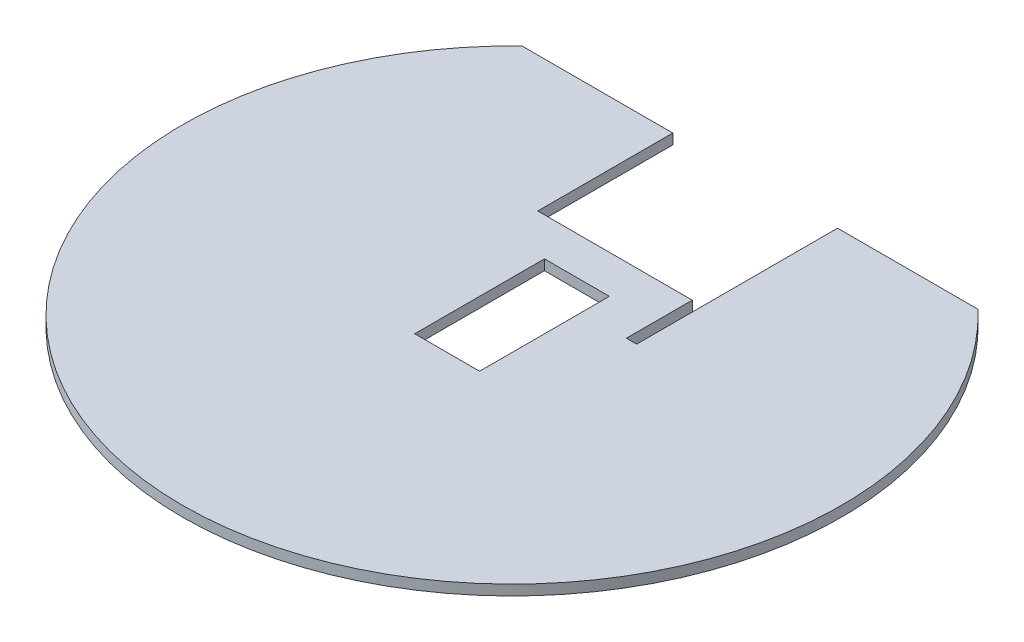
ISO-10303-21;
HEADER;
FILE_DESCRIPTION(('STEP AP214'),'2;1');
FILE_NAME('part.step','',(''),(''),'','','');
FILE_SCHEMA(('AUTOMOTIVE_DESIGN { 1 0 10303 214 1 1 1 1 }'));
ENDSEC;
DATA;
#1=APPLICATION_CONTEXT('core data for automotive mechanical design processes');
#2=APPLICATION_PROTOCOL_DEFINITION('international standard','automotive_design',2000,#1);
#3=PRODUCT_CONTEXT('',#1,'mechanical');
#4=PRODUCT('Part','Part','',(#3));
#5=PRODUCT_RELATED_PRODUCT_CATEGORY('part','',(#4));
#6=PRODUCT_DEFINITION_FORMATION('','',#4);
#7=PRODUCT_DEFINITION_CONTEXT('part definition',#1,'design');
#8=PRODUCT_DEFINITION('design','',#6,#7);
#9=PRODUCT_DEFINITION_SHAPE('','',#8);
#10=(LENGTH_UNIT() NAMED_UNIT(*) SI_UNIT(.MILLI.,.METRE.));
#11=(NAMED_UNIT(*) PLANE_ANGLE_UNIT() SI_UNIT($,.RADIAN.));
#12=(NAMED_UNIT(*) SI_UNIT($,.STERADIAN.) SOLID_ANGLE_UNIT());
#13=UNCERTAINTY_MEASURE_WITH_UNIT(LENGTH_MEASURE(1.E-05),#10,'distance_accuracy_value','');
#14=(GEOMETRIC_REPRESENTATION_CONTEXT(3) GLOBAL_UNCERTAINTY_ASSIGNED_CONTEXT((#13)) GLOBAL_UNIT_ASSIGNED_CONTEXT((#10,
#11,#12)) REPRESENTATION_CONTEXT('',''));
#15=CARTESIAN_POINT('',(0.,0.,0.));
#16=DIRECTION('',(0.,0.,1.));
#17=DIRECTION('',(1.,0.,0.));
#18=AXIS2_PLACEMENT_3D('',#15,#16,#17);
#19=CARTESIAN_POINT('',(-23.8125,3.175,0.));
#20=DIRECTION('',(-1.,0.,0.));
#21=DIRECTION('',(0.,0.,1.));
#22=AXIS2_PLACEMENT_3D('',#19,#20,#21);
#23=PLANE('',#22);
#24=DIRECTION('',(0.,0.,-1.));
#25=VECTOR('',#24,1.);
#26=CARTESIAN_POINT('',(-23.8125,0.,0.));
#27=LINE('',#26,#25);
#28=CARTESIAN_POINT('',(-23.8125,0.,-31.75));
#29=VERTEX_POINT('',#28);
#30=CARTESIAN_POINT('',(-23.8125,0.,-73.3700604624195));
#31=VERTEX_POINT('',#30);
#32=EDGE_CURVE('E142',#29,#31,#27,.T.);
#33=ORIENTED_EDGE('',*,*,#32,.T.);
#34=DIRECTION('',(0.,1.,0.));
#35=VECTOR('',#34,1.);
#36=CARTESIAN_POINT('',(-23.8125,3.175,-73.3700604624195));
#37=LINE('',#36,#35);
#38=CARTESIAN_POINT('',(-23.8125,3.175,-73.3700604624195));
#39=VERTEX_POINT('',#38);
#40=EDGE_CURVE('E49',#31,#39,#37,.T.);
#41=ORIENTED_EDGE('',*,*,#40,.T.);
#42=DIRECTION('',(0.,0.,-1.));
#43=VECTOR('',#42,1.);
#44=CARTESIAN_POINT('',(-23.8125,3.175,0.));
#45=LINE('',#44,#43);
#46=CARTESIAN_POINT('',(-23.8125,3.175,-31.75));
#47=VERTEX_POINT('',#46);
#48=EDGE_CURVE('E145',#47,#39,#45,.T.);
#49=ORIENTED_EDGE('',*,*,#48,.F.);
#50=DIRECTION('',(0.,-1.,0.));
#51=VECTOR('',#50,1.);
#52=CARTESIAN_POINT('',(-23.8125,3.175,-31.75));
#53=LINE('',#52,#51);
#54=EDGE_CURVE('E151',#47,#29,#53,.T.);
#55=ORIENTED_EDGE('',*,*,#54,.T.);
#56=EDGE_LOOP('',(#33,#41,#49,#55));
#57=FACE_BOUND('',#56,.T.);
#58=ADVANCED_FACE('F35',(#57),#23,.F.);
#59=CARTESIAN_POINT('',(0.,3.175,0.));
#60=DIRECTION('',(0.,-1.,0.));
#61=DIRECTION('',(0.,0.,-1.));
#62=AXIS2_PLACEMENT_3D('',#59,#60,#61);
#63=CYLINDRICAL_SURFACE('',#62,101.6);
#64=CARTESIAN_POINT('',(0.,3.175,0.));
#65=DIRECTION('',(0.,1.,0.));
#66=DIRECTION('',(0.,0.,1.));
#67=AXIS2_PLACEMENT_3D('',#64,#65,#66);
#68=CIRCLE('',#67,101.6);
#69=CARTESIAN_POINT('',(-70.2808240399962,3.175,-73.3700604624195));
#70=VERTEX_POINT('',#69);
#71=CARTESIAN_POINT('',(70.2808240399962,3.175,-73.3700604624195));
#72=VERTEX_POINT('',#71);
#73=EDGE_CURVE('E136',#70,#72,#68,.T.);
#74=ORIENTED_EDGE('',*,*,#73,.F.);
#75=DIRECTION('',(0.,1.,0.));
#76=VECTOR('',#75,1.);
#77=CARTESIAN_POINT('',(-70.2808240399962,0.,-73.3700604624195));
#78=LINE('',#77,#76);
#79=CARTESIAN_POINT('',(-70.2808240399962,0.,-73.3700604624195));
#80=VERTEX_POINT('',#79);
#81=EDGE_CURVE('E122',#80,#70,#78,.T.);
#82=ORIENTED_EDGE('',*,*,#81,.F.);
#83=CARTESIAN_POINT('',(0.,0.,0.));
#84=DIRECTION('',(0.,1.,0.));
#85=DIRECTION('',(0.,0.,1.));
#86=AXIS2_PLACEMENT_3D('',#83,#84,#85);
#87=CIRCLE('',#86,101.6);
#88=CARTESIAN_POINT('',(70.2808240399962,0.,-73.3700604624195));
#89=VERTEX_POINT('',#88);
#90=EDGE_CURVE('E134',#80,#89,#87,.T.);
#91=ORIENTED_EDGE('',*,*,#90,.T.);
#92=DIRECTION('',(0.,1.,0.));
#93=VECTOR('',#92,1.);
#94=CARTESIAN_POINT('',(70.2808240399962,0.,-73.3700604624195));
#95=LINE('',#94,#93);
#96=EDGE_CURVE('E137',#89,#72,#95,.T.);
#97=ORIENTED_EDGE('',*,*,#96,.T.);
#98=EDGE_LOOP('',(#74,#82,#91,#97));
#99=FACE_BOUND('',#98,.T.);
#100=ADVANCED_FACE('F132',(#99),#63,.T.);
#101=CARTESIAN_POINT('',(0.,3.175,-31.75));
#102=DIRECTION('',(0.,0.,-1.));
#103=DIRECTION('',(-1.,0.,0.));
#104=AXIS2_PLACEMENT_3D('',#101,#102,#103);
#105=PLANE('',#104);
#106=DIRECTION('',(1.,0.,0.));
#107=VECTOR('',#106,1.);
#108=CARTESIAN_POINT('',(0.,0.,-31.75));
#109=LINE('',#108,#107);
#110=CARTESIAN_POINT('',(23.8125,0.,-31.75));
#111=VERTEX_POINT('',#110);
#112=EDGE_CURVE('E141',#29,#111,#109,.T.);
#113=ORIENTED_EDGE('',*,*,#112,.F.);
#114=ORIENTED_EDGE('',*,*,#54,.F.);
#115=DIRECTION('',(1.,0.,0.));
#116=VECTOR('',#115,1.);
#117=CARTESIAN_POINT('',(0.,3.175,-31.75));
#118=LINE('',#117,#116);
#119=CARTESIAN_POINT('',(23.8125,3.175,-31.75));
#120=VERTEX_POINT('',#119);
#121=EDGE_CURVE('E154',#47,#120,#118,.T.);
#122=ORIENTED_EDGE('',*,*,#121,.T.);
#123=DIRECTION('',(0.,-1.,0.));
#124=VECTOR('',#123,1.);
#125=CARTESIAN_POINT('',(23.8125,3.175,-31.75));
#126=LINE('',#125,#124);
#127=EDGE_CURVE('E153',#120,#111,#126,.T.);
#128=ORIENTED_EDGE('',*,*,#127,.T.);
#129=EDGE_LOOP('',(#113,#114,#122,#128));
#130=FACE_BOUND('',#129,.T.);
#131=ADVANCED_FACE('F168',(#130),#105,.T.);
#132=CARTESIAN_POINT('',(0.,3.175,0.));
#133=DIRECTION('',(0.,1.,0.));
#134=DIRECTION('',(0.,0.,1.));
#135=AXIS2_PLACEMENT_3D('',#132,#133,#134);
#136=PLANE('',#135);
#137=DIRECTION('',(1.,0.,0.));
#138=VECTOR('',#137,1.);
#139=CARTESIAN_POINT('',(-70.2808240399962,3.175,-73.3700604624195));
#140=LINE('',#139,#138);
#141=EDGE_CURVE('E223',#70,#39,#140,.T.);
#142=ORIENTED_EDGE('',*,*,#141,.F.);
#143=ORIENTED_EDGE('',*,*,#73,.T.);
#144=CARTESIAN_POINT('',(26.9875,3.175,-73.3700604624195));
#145=VERTEX_POINT('',#144);
#146=EDGE_CURVE('E224',#145,#72,#140,.T.);
#147=ORIENTED_EDGE('',*,*,#146,.F.);
#148=DIRECTION('',(0.,0.,-1.));
#149=VECTOR('',#148,1.);
#150=CARTESIAN_POINT('',(26.9875,3.175,-101.6));
#151=LINE('',#150,#149);
#152=CARTESIAN_POINT('',(26.9875,3.175,-11.43));
#153=VERTEX_POINT('',#152);
#154=EDGE_CURVE('E179',#153,#145,#151,.T.);
#155=ORIENTED_EDGE('',*,*,#154,.F.);
#156=DIRECTION('',(1.,0.,0.));
#157=VECTOR('',#156,1.);
#158=CARTESIAN_POINT('',(23.8125,3.175,-11.43));
#159=LINE('',#158,#157);
#160=CARTESIAN_POINT('',(23.8125,3.175,-11.43));
#161=VERTEX_POINT('',#160);
#162=EDGE_CURVE('E182',#161,#153,#159,.T.);
#163=ORIENTED_EDGE('',*,*,#162,.F.);
#164=DIRECTION('',(0.,0.,1.));
#165=VECTOR('',#164,1.);
#166=CARTESIAN_POINT('',(23.8125,3.175,-101.6));
#167=LINE('',#166,#165);
#168=EDGE_CURVE('E185',#120,#161,#167,.T.);
#169=ORIENTED_EDGE('',*,*,#168,.F.);
#170=ORIENTED_EDGE('',*,*,#121,.F.);
#171=ORIENTED_EDGE('',*,*,#48,.T.);
#172=EDGE_LOOP('',(#142,#143,#147,#155,#163,#169,#170,#171));
#173=FACE_BOUND('',#172,.T.);
#174=DIRECTION('',(0.,0.,-1.));
#175=VECTOR('',#174,1.);
#176=CARTESIAN_POINT('',(10.,3.175,20.));
#177=LINE('',#176,#175);
#178=CARTESIAN_POINT('',(10.,3.175,20.));
#179=VERTEX_POINT('',#178);
#180=CARTESIAN_POINT('',(10.,3.175,-20.));
#181=VERTEX_POINT('',#180);
#182=EDGE_CURVE('E209',#179,#181,#177,.T.);
#183=ORIENTED_EDGE('',*,*,#182,.F.);
#184=DIRECTION('',(1.,0.,0.));
#185=VECTOR('',#184,1.);
#186=CARTESIAN_POINT('',(-9.99999999999999,3.175,20.));
#187=LINE('',#186,#185);
#188=CARTESIAN_POINT('',(-9.99999999999999,3.175,20.));
#189=VERTEX_POINT('',#188);
#190=EDGE_CURVE('E199',#189,#179,#187,.T.);
#191=ORIENTED_EDGE('',*,*,#190,.F.);
#192=DIRECTION('',(0.,0.,1.));
#193=VECTOR('',#192,1.);
#194=CARTESIAN_POINT('',(-9.99999999999999,3.175,20.));
#195=LINE('',#194,#193);
#196=CARTESIAN_POINT('',(-9.99999999999999,3.175,-20.));
#197=VERTEX_POINT('',#196);
#198=EDGE_CURVE('E203',#197,#189,#195,.T.);
#199=ORIENTED_EDGE('',*,*,#198,.F.);
#200=DIRECTION('',(-1.,0.,0.));
#201=VECTOR('',#200,1.);
#202=CARTESIAN_POINT('',(-9.99999999999999,3.175,-20.));
#203=LINE('',#202,#201);
#204=EDGE_CURVE('E206',#181,#197,#203,.T.);
#205=ORIENTED_EDGE('',*,*,#204,.F.);
#206=EDGE_LOOP('',(#183,#191,#199,#205));
#207=FACE_BOUND('',#206,.T.);
#208=ADVANCED_FACE('F228',(#173,#207),#136,.T.);
#209=CARTESIAN_POINT('',(0.,0.,0.));
#210=DIRECTION('',(0.,1.,0.));
#211=DIRECTION('',(0.,0.,1.));
#212=AXIS2_PLACEMENT_3D('',#209,#210,#211);
#213=PLANE('',#212);
#214=DIRECTION('',(1.,0.,0.));
#215=VECTOR('',#214,1.);
#216=CARTESIAN_POINT('',(-9.99999999999999,0.,20.));
#217=LINE('',#216,#215);
#218=CARTESIAN_POINT('',(-9.99999999999999,0.,20.));
#219=VERTEX_POINT('',#218);
#220=CARTESIAN_POINT('',(10.,0.,20.));
#221=VERTEX_POINT('',#220);
#222=EDGE_CURVE('E194',#219,#221,#217,.T.);
#223=ORIENTED_EDGE('',*,*,#222,.T.);
#224=DIRECTION('',(0.,0.,-1.));
#225=VECTOR('',#224,1.);
#226=CARTESIAN_POINT('',(10.,0.,20.));
#227=LINE('',#226,#225);
#228=CARTESIAN_POINT('',(10.,0.,-20.));
#229=VERTEX_POINT('',#228);
#230=EDGE_CURVE('E202',#221,#229,#227,.T.);
#231=ORIENTED_EDGE('',*,*,#230,.T.);
#232=DIRECTION('',(-1.,0.,0.));
#233=VECTOR('',#232,1.);
#234=CARTESIAN_POINT('',(-9.99999999999999,0.,-20.));
#235=LINE('',#234,#233);
#236=CARTESIAN_POINT('',(-9.99999999999999,0.,-20.));
#237=VERTEX_POINT('',#236);
#238=EDGE_CURVE('E216',#229,#237,#235,.T.);
#239=ORIENTED_EDGE('',*,*,#238,.T.);
#240=DIRECTION('',(0.,0.,1.));
#241=VECTOR('',#240,1.);
#242=CARTESIAN_POINT('',(-9.99999999999999,0.,20.));
#243=LINE('',#242,#241);
#244=EDGE_CURVE('E213',#237,#219,#243,.T.);
#245=ORIENTED_EDGE('',*,*,#244,.T.);
#246=EDGE_LOOP('',(#223,#231,#239,#245));
#247=FACE_BOUND('',#246,.T.);
#248=ORIENTED_EDGE('',*,*,#90,.F.);
#249=DIRECTION('',(1.,0.,0.));
#250=VECTOR('',#249,1.);
#251=CARTESIAN_POINT('',(-70.2808240399962,0.,-73.3700604624195));
#252=LINE('',#251,#250);
#253=EDGE_CURVE('E119',#80,#31,#252,.T.);
#254=ORIENTED_EDGE('',*,*,#253,.T.);
#255=ORIENTED_EDGE('',*,*,#32,.F.);
#256=ORIENTED_EDGE('',*,*,#112,.T.);
#257=DIRECTION('',(0.,0.,1.));
#258=VECTOR('',#257,1.);
#259=CARTESIAN_POINT('',(23.8125,0.,0.));
#260=LINE('',#259,#258);
#261=CARTESIAN_POINT('',(23.8125,0.,-11.43));
#262=VERTEX_POINT('',#261);
#263=EDGE_CURVE('E42',#111,#262,#260,.T.);
#264=ORIENTED_EDGE('',*,*,#263,.T.);
#265=DIRECTION('',(1.,0.,0.));
#266=VECTOR('',#265,1.);
#267=CARTESIAN_POINT('',(23.8125,0.,-11.43));
#268=LINE('',#267,#266);
#269=CARTESIAN_POINT('',(26.9875,0.,-11.43));
#270=VERTEX_POINT('',#269);
#271=EDGE_CURVE('E159',#262,#270,#268,.T.);
#272=ORIENTED_EDGE('',*,*,#271,.T.);
#273=DIRECTION('',(0.,0.,-1.));
#274=VECTOR('',#273,1.);
#275=CARTESIAN_POINT('',(26.9875,0.,-101.6));
#276=LINE('',#275,#274);
#277=CARTESIAN_POINT('',(26.9875,0.,-73.3700604624195));
#278=VERTEX_POINT('',#277);
#279=EDGE_CURVE('E177',#270,#278,#276,.T.);
#280=ORIENTED_EDGE('',*,*,#279,.T.);
#281=EDGE_CURVE('E57',#278,#89,#252,.T.);
#282=ORIENTED_EDGE('',*,*,#281,.T.);
#283=EDGE_LOOP('',(#248,#254,#255,#256,#264,#272,#280,#282));
#284=FACE_BOUND('',#283,.T.);
#285=ADVANCED_FACE('F139',(#247,#284),#213,.F.);
#286=CARTESIAN_POINT('',(26.9875,0.,-101.6));
#287=DIRECTION('',(1.,0.,0.));
#288=DIRECTION('',(0.,0.,-1.));
#289=AXIS2_PLACEMENT_3D('',#286,#287,#288);
#290=PLANE('',#289);
#291=ORIENTED_EDGE('',*,*,#154,.T.);
#292=DIRECTION('',(0.,-1.,0.));
#293=VECTOR('',#292,1.);
#294=CARTESIAN_POINT('',(26.9875,0.,-73.3700604624195));
#295=LINE('',#294,#293);
#296=EDGE_CURVE('E11',#145,#278,#295,.T.);
#297=ORIENTED_EDGE('',*,*,#296,.T.);
#298=ORIENTED_EDGE('',*,*,#279,.F.);
#299=DIRECTION('',(0.,1.,0.));
#300=VECTOR('',#299,1.);
#301=CARTESIAN_POINT('',(26.9875,0.,-11.43));
#302=LINE('',#301,#300);
#303=EDGE_CURVE('E147',#270,#153,#302,.T.);
#304=ORIENTED_EDGE('',*,*,#303,.T.);
#305=EDGE_LOOP('',(#291,#297,#298,#304));
#306=FACE_BOUND('',#305,.T.);
#307=ADVANCED_FACE('F242',(#306),#290,.F.);
#308=CARTESIAN_POINT('',(23.8125,0.,-101.6));
#309=DIRECTION('',(-1.,0.,0.));
#310=DIRECTION('',(0.,0.,1.));
#311=AXIS2_PLACEMENT_3D('',#308,#309,#310);
#312=PLANE('',#311);
#313=ORIENTED_EDGE('',*,*,#127,.F.);
#314=ORIENTED_EDGE('',*,*,#168,.T.);
#315=DIRECTION('',(0.,1.,0.));
#316=VECTOR('',#315,1.);
#317=CARTESIAN_POINT('',(23.8125,0.,-11.43));
#318=LINE('',#317,#316);
#319=EDGE_CURVE('E165',#262,#161,#318,.T.);
#320=ORIENTED_EDGE('',*,*,#319,.F.);
#321=ORIENTED_EDGE('',*,*,#263,.F.);
#322=EDGE_LOOP('',(#313,#314,#320,#321));
#323=FACE_BOUND('',#322,.T.);
#324=ADVANCED_FACE('F162',(#323),#312,.F.);
#325=CARTESIAN_POINT('',(23.8125,0.,-11.43));
#326=DIRECTION('',(0.,0.,1.));
#327=DIRECTION('',(1.,0.,0.));
#328=AXIS2_PLACEMENT_3D('',#325,#326,#327);
#329=PLANE('',#328);
#330=ORIENTED_EDGE('',*,*,#162,.T.);
#331=ORIENTED_EDGE('',*,*,#303,.F.);
#332=ORIENTED_EDGE('',*,*,#271,.F.);
#333=ORIENTED_EDGE('',*,*,#319,.T.);
#334=EDGE_LOOP('',(#330,#331,#332,#333));
#335=FACE_BOUND('',#334,.T.);
#336=ADVANCED_FACE('F248',(#335),#329,.F.);
#337=CARTESIAN_POINT('',(10.,0.,20.));
#338=DIRECTION('',(1.,0.,0.));
#339=DIRECTION('',(0.,0.,-1.));
#340=AXIS2_PLACEMENT_3D('',#337,#338,#339);
#341=PLANE('',#340);
#342=ORIENTED_EDGE('',*,*,#182,.T.);
#343=DIRECTION('',(0.,1.,0.));
#344=VECTOR('',#343,1.);
#345=CARTESIAN_POINT('',(10.,0.,-20.));
#346=LINE('',#345,#344);
#347=EDGE_CURVE('E190',#229,#181,#346,.T.);
#348=ORIENTED_EDGE('',*,*,#347,.F.);
#349=ORIENTED_EDGE('',*,*,#230,.F.);
#350=DIRECTION('',(0.,1.,0.));
#351=VECTOR('',#350,1.);
#352=CARTESIAN_POINT('',(10.,0.,20.));
#353=LINE('',#352,#351);
#354=EDGE_CURVE('E187',#221,#179,#353,.T.);
#355=ORIENTED_EDGE('',*,*,#354,.T.);
#356=EDGE_LOOP('',(#342,#348,#349,#355));
#357=FACE_BOUND('',#356,.T.);
#358=ADVANCED_FACE('F251',(#357),#341,.F.);
#359=CARTESIAN_POINT('',(-9.99999999999999,0.,20.));
#360=DIRECTION('',(0.,0.,1.));
#361=DIRECTION('',(1.,0.,0.));
#362=AXIS2_PLACEMENT_3D('',#359,#360,#361);
#363=PLANE('',#362);
#364=ORIENTED_EDGE('',*,*,#190,.T.);
#365=ORIENTED_EDGE('',*,*,#354,.F.);
#366=ORIENTED_EDGE('',*,*,#222,.F.);
#367=DIRECTION('',(0.,1.,0.));
#368=VECTOR('',#367,1.);
#369=CARTESIAN_POINT('',(-9.99999999999999,0.,20.));
#370=LINE('',#369,#368);
#371=EDGE_CURVE('E196',#219,#189,#370,.T.);
#372=ORIENTED_EDGE('',*,*,#371,.T.);
#373=EDGE_LOOP('',(#364,#365,#366,#372));
#374=FACE_BOUND('',#373,.T.);
#375=ADVANCED_FACE('F258',(#374),#363,.F.);
#376=CARTESIAN_POINT('',(-9.99999999999999,0.,20.));
#377=DIRECTION('',(-1.,0.,0.));
#378=DIRECTION('',(0.,0.,1.));
#379=AXIS2_PLACEMENT_3D('',#376,#377,#378);
#380=PLANE('',#379);
#381=ORIENTED_EDGE('',*,*,#198,.T.);
#382=ORIENTED_EDGE('',*,*,#371,.F.);
#383=ORIENTED_EDGE('',*,*,#244,.F.);
#384=DIRECTION('',(0.,1.,0.));
#385=VECTOR('',#384,1.);
#386=CARTESIAN_POINT('',(-9.99999999999999,0.,-20.));
#387=LINE('',#386,#385);
#388=EDGE_CURVE('E193',#237,#197,#387,.T.);
#389=ORIENTED_EDGE('',*,*,#388,.T.);
#390=EDGE_LOOP('',(#381,#382,#383,#389));
#391=FACE_BOUND('',#390,.T.);
#392=ADVANCED_FACE('F263',(#391),#380,.F.);
#393=CARTESIAN_POINT('',(-9.99999999999999,0.,-20.));
#394=DIRECTION('',(0.,0.,-1.));
#395=DIRECTION('',(-1.,0.,0.));
#396=AXIS2_PLACEMENT_3D('',#393,#394,#395);
#397=PLANE('',#396);
#398=ORIENTED_EDGE('',*,*,#204,.T.);
#399=ORIENTED_EDGE('',*,*,#388,.F.);
#400=ORIENTED_EDGE('',*,*,#238,.F.);
#401=ORIENTED_EDGE('',*,*,#347,.T.);
#402=EDGE_LOOP('',(#398,#399,#400,#401));
#403=FACE_BOUND('',#402,.T.);
#404=ADVANCED_FACE('F260',(#403),#397,.F.);
#405=CARTESIAN_POINT('',(-70.2808240399962,0.,-73.3700604624195));
#406=DIRECTION('',(0.,0.,1.));
#407=DIRECTION('',(1.,0.,0.));
#408=AXIS2_PLACEMENT_3D('',#405,#406,#407);
#409=PLANE('',#408);
#410=ORIENTED_EDGE('',*,*,#146,.T.);
#411=ORIENTED_EDGE('',*,*,#96,.F.);
#412=ORIENTED_EDGE('',*,*,#281,.F.);
#413=ORIENTED_EDGE('',*,*,#296,.F.);
#414=EDGE_LOOP('',(#410,#411,#412,#413));
#415=FACE_BOUND('',#414,.T.);
#416=ADVANCED_FACE('F226',(#415),#409,.F.);
#417=ORIENTED_EDGE('',*,*,#253,.F.);
#418=ORIENTED_EDGE('',*,*,#81,.T.);
#419=ORIENTED_EDGE('',*,*,#141,.T.);
#420=ORIENTED_EDGE('',*,*,#40,.F.);
#421=EDGE_LOOP('',(#417,#418,#419,#420));
#422=FACE_BOUND('',#421,.T.);
#423=ADVANCED_FACE('F121',(#422),#409,.F.);
#424=CLOSED_SHELL('',(#58,#100,#131,#208,#285,#307,#324,#336,#358,#375,#392,#404,#416,#423));
#425=MANIFOLD_SOLID_BREP('B2',#424);
#426=ADVANCED_BREP_SHAPE_REPRESENTATION('',(#18,#425),#14);
#427=SHAPE_DEFINITION_REPRESENTATION(#9,#426);
ENDSEC;
END-ISO-10303-21;
